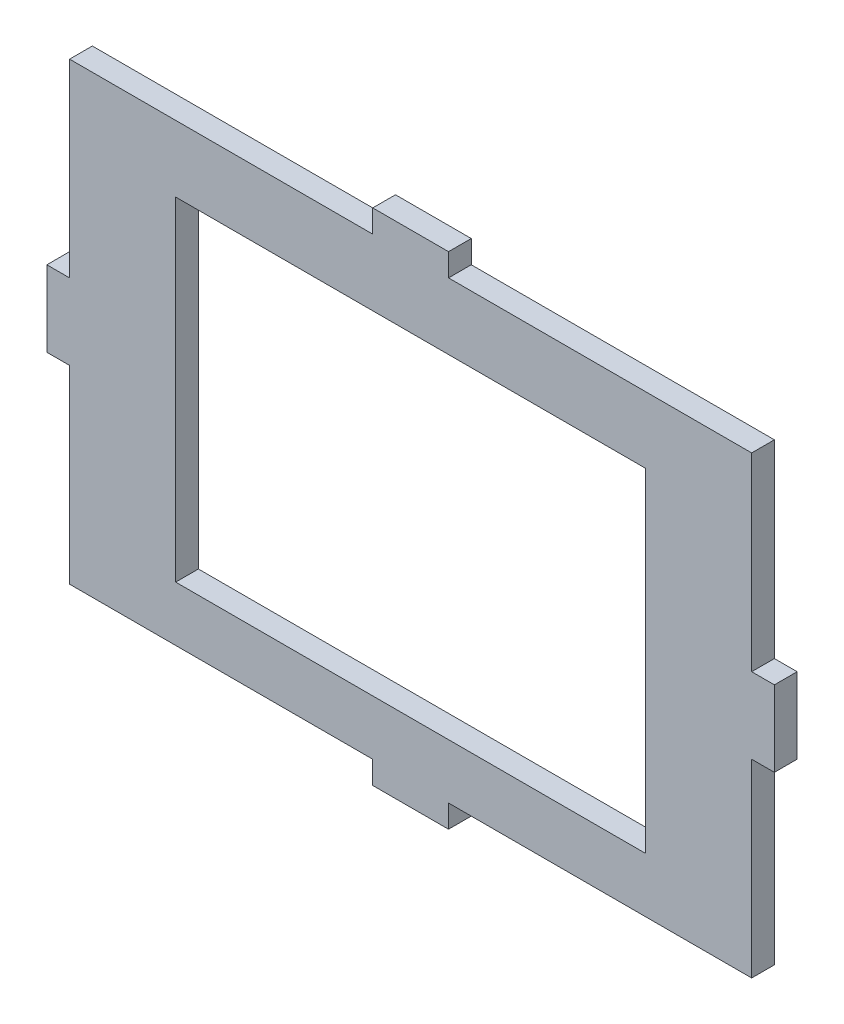
ISO-10303-21;
HEADER;
FILE_DESCRIPTION(('STEP AP214'),'2;1');
FILE_NAME('part.step','',(''),(''),'','','');
FILE_SCHEMA(('AUTOMOTIVE_DESIGN { 1 0 10303 214 1 1 1 1 }'));
ENDSEC;
DATA;
#1=APPLICATION_CONTEXT('core data for automotive mechanical design processes');
#2=APPLICATION_PROTOCOL_DEFINITION('international standard','automotive_design',2000,#1);
#3=PRODUCT_CONTEXT('',#1,'mechanical');
#4=PRODUCT('Part','Part','',(#3));
#5=PRODUCT_RELATED_PRODUCT_CATEGORY('part','',(#4));
#6=PRODUCT_DEFINITION_FORMATION('','',#4);
#7=PRODUCT_DEFINITION_CONTEXT('part definition',#1,'design');
#8=PRODUCT_DEFINITION('design','',#6,#7);
#9=PRODUCT_DEFINITION_SHAPE('','',#8);
#10=(LENGTH_UNIT() NAMED_UNIT(*) SI_UNIT(.MILLI.,.METRE.));
#11=(NAMED_UNIT(*) PLANE_ANGLE_UNIT() SI_UNIT($,.RADIAN.));
#12=(NAMED_UNIT(*) SI_UNIT($,.STERADIAN.) SOLID_ANGLE_UNIT());
#13=UNCERTAINTY_MEASURE_WITH_UNIT(LENGTH_MEASURE(1.E-05),#10,'distance_accuracy_value','');
#14=(GEOMETRIC_REPRESENTATION_CONTEXT(3) GLOBAL_UNCERTAINTY_ASSIGNED_CONTEXT((#13)) GLOBAL_UNIT_ASSIGNED_CONTEXT((#10,
#11,#12)) REPRESENTATION_CONTEXT('',''));
#15=CARTESIAN_POINT('',(0.,0.,0.));
#16=DIRECTION('',(0.,0.,1.));
#17=DIRECTION('',(1.,0.,0.));
#18=AXIS2_PLACEMENT_3D('',#15,#16,#17);
#19=CARTESIAN_POINT('',(0.,30.7594941139017,3.));
#20=DIRECTION('',(1.,0.,0.));
#21=DIRECTION('',(0.,0.,-1.));
#22=AXIS2_PLACEMENT_3D('',#19,#20,#21);
#23=PLANE('',#22);
#24=DIRECTION('',(0.,0.,-1.));
#25=VECTOR('',#24,1.);
#26=CARTESIAN_POINT('',(0.,5.76165506551438,0.));
#27=LINE('',#26,#25);
#28=CARTESIAN_POINT('',(0.,5.76165506551438,3.));
#29=VERTEX_POINT('',#28);
#30=CARTESIAN_POINT('',(0.,5.76165506551438,0.));
#31=VERTEX_POINT('',#30);
#32=EDGE_CURVE('E57',#29,#31,#27,.T.);
#33=ORIENTED_EDGE('',*,*,#32,.F.);
#34=DIRECTION('',(0.,-1.,0.));
#35=VECTOR('',#34,1.);
#36=CARTESIAN_POINT('',(0.,30.7594941139017,3.));
#37=LINE('',#36,#35);
#38=CARTESIAN_POINT('',(0.,30.7594941139017,3.));
#39=VERTEX_POINT('',#38);
#40=EDGE_CURVE('E217',#39,#29,#37,.T.);
#41=ORIENTED_EDGE('',*,*,#40,.F.);
#42=DIRECTION('',(0.,0.,-1.));
#43=VECTOR('',#42,1.);
#44=CARTESIAN_POINT('',(0.,30.7594941139017,3.));
#45=LINE('',#44,#43);
#46=CARTESIAN_POINT('',(0.,30.7594941139017,0.));
#47=VERTEX_POINT('',#46);
#48=EDGE_CURVE('E348',#39,#47,#45,.T.);
#49=ORIENTED_EDGE('',*,*,#48,.T.);
#50=DIRECTION('',(0.,-1.,0.));
#51=VECTOR('',#50,1.);
#52=CARTESIAN_POINT('',(0.,30.7594941139017,0.));
#53=LINE('',#52,#51);
#54=EDGE_CURVE('E349',#47,#31,#53,.T.);
#55=ORIENTED_EDGE('',*,*,#54,.T.);
#56=EDGE_LOOP('',(#33,#41,#49,#55));
#57=FACE_BOUND('',#56,.T.);
#58=ADVANCED_FACE('F34',(#57),#23,.F.);
#59=CARTESIAN_POINT('',(89.9870342903238,30.7594941139017,3.));
#60=DIRECTION('',(-1.,0.,0.));
#61=DIRECTION('',(0.,0.,1.));
#62=AXIS2_PLACEMENT_3D('',#59,#60,#61);
#63=PLANE('',#62);
#64=DIRECTION('',(0.,0.,-1.));
#65=VECTOR('',#64,1.);
#66=CARTESIAN_POINT('',(89.9870342903238,-4.23834493448562,0.));
#67=LINE('',#66,#65);
#68=CARTESIAN_POINT('',(89.9870342903238,-4.23834493448562,3.));
#69=VERTEX_POINT('',#68);
#70=CARTESIAN_POINT('',(89.9870342903238,-4.23834493448562,0.));
#71=VERTEX_POINT('',#70);
#72=EDGE_CURVE('E220',#69,#71,#67,.T.);
#73=ORIENTED_EDGE('',*,*,#72,.F.);
#74=DIRECTION('',(0.,1.,0.));
#75=VECTOR('',#74,1.);
#76=CARTESIAN_POINT('',(89.9870342903238,30.7594941139017,3.));
#77=LINE('',#76,#75);
#78=CARTESIAN_POINT('',(89.9870342903238,-29.2361839828729,3.));
#79=VERTEX_POINT('',#78);
#80=EDGE_CURVE('E341',#79,#69,#77,.T.);
#81=ORIENTED_EDGE('',*,*,#80,.F.);
#82=DIRECTION('',(0.,0.,-1.));
#83=VECTOR('',#82,1.);
#84=CARTESIAN_POINT('',(89.9870342903238,-29.2361839828729,3.));
#85=LINE('',#84,#83);
#86=CARTESIAN_POINT('',(89.9870342903238,-29.2361839828729,0.));
#87=VERTEX_POINT('',#86);
#88=EDGE_CURVE('E42',#79,#87,#85,.T.);
#89=ORIENTED_EDGE('',*,*,#88,.T.);
#90=DIRECTION('',(0.,1.,0.));
#91=VECTOR('',#90,1.);
#92=CARTESIAN_POINT('',(89.9870342903238,30.7594941139017,0.));
#93=LINE('',#92,#91);
#94=EDGE_CURVE('E355',#87,#71,#93,.T.);
#95=ORIENTED_EDGE('',*,*,#94,.T.);
#96=EDGE_LOOP('',(#73,#81,#89,#95));
#97=FACE_BOUND('',#96,.T.);
#98=ADVANCED_FACE('F369',(#97),#63,.F.);
#99=CARTESIAN_POINT('',(0.,-29.2361839828729,3.));
#100=DIRECTION('',(0.,1.,0.));
#101=DIRECTION('',(0.,0.,1.));
#102=AXIS2_PLACEMENT_3D('',#99,#100,#101);
#103=PLANE('',#102);
#104=DIRECTION('',(0.,0.,1.));
#105=VECTOR('',#104,1.);
#106=CARTESIAN_POINT('',(49.9935171451619,-29.2361839828729,0.));
#107=LINE('',#106,#105);
#108=CARTESIAN_POINT('',(49.9935171451619,-29.2361839828729,0.));
#109=VERTEX_POINT('',#108);
#110=CARTESIAN_POINT('',(49.9935171451619,-29.2361839828729,3.));
#111=VERTEX_POINT('',#110);
#112=EDGE_CURVE('E249',#109,#111,#107,.T.);
#113=ORIENTED_EDGE('',*,*,#112,.F.);
#114=DIRECTION('',(1.,0.,0.));
#115=VECTOR('',#114,1.);
#116=CARTESIAN_POINT('',(0.,-29.2361839828729,0.));
#117=LINE('',#116,#115);
#118=EDGE_CURVE('E351',#109,#87,#117,.T.);
#119=ORIENTED_EDGE('',*,*,#118,.T.);
#120=ORIENTED_EDGE('',*,*,#88,.F.);
#121=DIRECTION('',(1.,0.,0.));
#122=VECTOR('',#121,1.);
#123=CARTESIAN_POINT('',(0.,-29.2361839828729,3.));
#124=LINE('',#123,#122);
#125=EDGE_CURVE('E336',#111,#79,#124,.T.);
#126=ORIENTED_EDGE('',*,*,#125,.F.);
#127=EDGE_LOOP('',(#113,#119,#120,#126));
#128=FACE_BOUND('',#127,.T.);
#129=ADVANCED_FACE('F386',(#128),#103,.F.);
#130=CARTESIAN_POINT('',(0.,30.7594941139017,3.));
#131=DIRECTION('',(0.,-1.,0.));
#132=DIRECTION('',(0.,0.,-1.));
#133=AXIS2_PLACEMENT_3D('',#130,#131,#132);
#134=PLANE('',#133);
#135=DIRECTION('',(0.,0.,1.));
#136=VECTOR('',#135,1.);
#137=CARTESIAN_POINT('',(39.9935171451619,30.7594941139017,0.));
#138=LINE('',#137,#136);
#139=CARTESIAN_POINT('',(39.9935171451619,30.7594941139017,0.));
#140=VERTEX_POINT('',#139);
#141=CARTESIAN_POINT('',(39.9935171451619,30.7594941139017,3.));
#142=VERTEX_POINT('',#141);
#143=EDGE_CURVE('E281',#140,#142,#138,.T.);
#144=ORIENTED_EDGE('',*,*,#143,.F.);
#145=DIRECTION('',(-1.,0.,0.));
#146=VECTOR('',#145,1.);
#147=CARTESIAN_POINT('',(0.,30.7594941139017,0.));
#148=LINE('',#147,#146);
#149=EDGE_CURVE('E357',#140,#47,#148,.T.);
#150=ORIENTED_EDGE('',*,*,#149,.T.);
#151=ORIENTED_EDGE('',*,*,#48,.F.);
#152=DIRECTION('',(-1.,0.,0.));
#153=VECTOR('',#152,1.);
#154=CARTESIAN_POINT('',(0.,30.7594941139017,3.));
#155=LINE('',#154,#153);
#156=EDGE_CURVE('E344',#142,#39,#155,.T.);
#157=ORIENTED_EDGE('',*,*,#156,.F.);
#158=EDGE_LOOP('',(#144,#150,#151,#157));
#159=FACE_BOUND('',#158,.T.);
#160=ADVANCED_FACE('F414',(#159),#134,.F.);
#161=CARTESIAN_POINT('',(0.,-4.23834493448562,3.));
#162=VERTEX_POINT('',#161);
#163=CARTESIAN_POINT('',(0.,-29.2361839828729,3.));
#164=VERTEX_POINT('',#163);
#165=EDGE_CURVE('E49',#162,#164,#37,.T.);
#166=ORIENTED_EDGE('',*,*,#165,.F.);
#167=DIRECTION('',(0.,0.,-1.));
#168=VECTOR('',#167,1.);
#169=CARTESIAN_POINT('',(0.,-4.23834493448562,0.));
#170=LINE('',#169,#168);
#171=CARTESIAN_POINT('',(0.,-4.23834493448562,0.));
#172=VERTEX_POINT('',#171);
#173=EDGE_CURVE('E214',#162,#172,#170,.T.);
#174=ORIENTED_EDGE('',*,*,#173,.T.);
#175=CARTESIAN_POINT('',(0.,-29.2361839828729,0.));
#176=VERTEX_POINT('',#175);
#177=EDGE_CURVE('E328',#172,#176,#53,.T.);
#178=ORIENTED_EDGE('',*,*,#177,.T.);
#179=DIRECTION('',(0.,0.,-1.));
#180=VECTOR('',#179,1.);
#181=CARTESIAN_POINT('',(0.,-29.2361839828729,3.));
#182=LINE('',#181,#180);
#183=EDGE_CURVE('E11',#164,#176,#182,.T.);
#184=ORIENTED_EDGE('',*,*,#183,.F.);
#185=EDGE_LOOP('',(#166,#174,#178,#184));
#186=FACE_BOUND('',#185,.T.);
#187=ADVANCED_FACE('F36',(#186),#23,.F.);
#188=CARTESIAN_POINT('',(39.9935171451619,-29.2361839828729,0.));
#189=VERTEX_POINT('',#188);
#190=EDGE_CURVE('E352',#176,#189,#117,.T.);
#191=ORIENTED_EDGE('',*,*,#190,.T.);
#192=DIRECTION('',(0.,0.,1.));
#193=VECTOR('',#192,1.);
#194=CARTESIAN_POINT('',(39.9935171451619,-29.2361839828729,0.));
#195=LINE('',#194,#193);
#196=CARTESIAN_POINT('',(39.9935171451619,-29.2361839828729,3.));
#197=VERTEX_POINT('',#196);
#198=EDGE_CURVE('E254',#189,#197,#195,.T.);
#199=ORIENTED_EDGE('',*,*,#198,.T.);
#200=EDGE_CURVE('E337',#164,#197,#124,.T.);
#201=ORIENTED_EDGE('',*,*,#200,.F.);
#202=ORIENTED_EDGE('',*,*,#183,.T.);
#203=EDGE_LOOP('',(#191,#199,#201,#202));
#204=FACE_BOUND('',#203,.T.);
#205=ADVANCED_FACE('F400',(#204),#103,.F.);
#206=CARTESIAN_POINT('',(89.9870342903238,5.76165506551438,3.));
#207=VERTEX_POINT('',#206);
#208=CARTESIAN_POINT('',(89.9870342903238,30.7594941139017,3.));
#209=VERTEX_POINT('',#208);
#210=EDGE_CURVE('E340',#207,#209,#77,.T.);
#211=ORIENTED_EDGE('',*,*,#210,.F.);
#212=DIRECTION('',(0.,0.,-1.));
#213=VECTOR('',#212,1.);
#214=CARTESIAN_POINT('',(89.9870342903238,5.76165506551438,0.));
#215=LINE('',#214,#213);
#216=CARTESIAN_POINT('',(89.9870342903238,5.76165506551438,0.));
#217=VERTEX_POINT('',#216);
#218=EDGE_CURVE('E218',#207,#217,#215,.T.);
#219=ORIENTED_EDGE('',*,*,#218,.T.);
#220=CARTESIAN_POINT('',(89.9870342903238,30.7594941139017,0.));
#221=VERTEX_POINT('',#220);
#222=EDGE_CURVE('E354',#217,#221,#93,.T.);
#223=ORIENTED_EDGE('',*,*,#222,.T.);
#224=DIRECTION('',(0.,0.,-1.));
#225=VECTOR('',#224,1.);
#226=CARTESIAN_POINT('',(89.9870342903238,30.7594941139017,3.));
#227=LINE('',#226,#225);
#228=EDGE_CURVE('E362',#209,#221,#227,.T.);
#229=ORIENTED_EDGE('',*,*,#228,.F.);
#230=EDGE_LOOP('',(#211,#219,#223,#229));
#231=FACE_BOUND('',#230,.T.);
#232=ADVANCED_FACE('F419',(#231),#63,.F.);
#233=CARTESIAN_POINT('',(49.9935171451619,30.7594941139017,0.));
#234=VERTEX_POINT('',#233);
#235=EDGE_CURVE('E358',#221,#234,#148,.T.);
#236=ORIENTED_EDGE('',*,*,#235,.T.);
#237=DIRECTION('',(0.,0.,1.));
#238=VECTOR('',#237,1.);
#239=CARTESIAN_POINT('',(49.9935171451619,30.7594941139017,0.));
#240=LINE('',#239,#238);
#241=CARTESIAN_POINT('',(49.9935171451619,30.7594941139017,3.));
#242=VERTEX_POINT('',#241);
#243=EDGE_CURVE('E276',#234,#242,#240,.T.);
#244=ORIENTED_EDGE('',*,*,#243,.T.);
#245=EDGE_CURVE('E345',#209,#242,#155,.T.);
#246=ORIENTED_EDGE('',*,*,#245,.F.);
#247=ORIENTED_EDGE('',*,*,#228,.T.);
#248=EDGE_LOOP('',(#236,#244,#246,#247));
#249=FACE_BOUND('',#248,.T.);
#250=ADVANCED_FACE('F422',(#249),#134,.F.);
#251=CARTESIAN_POINT('',(0.,0.,3.));
#252=DIRECTION('',(0.,0.,1.));
#253=DIRECTION('',(1.,0.,0.));
#254=AXIS2_PLACEMENT_3D('',#251,#252,#253);
#255=PLANE('',#254);
#256=DIRECTION('',(0.,-1.,0.));
#257=VECTOR('',#256,1.);
#258=CARTESIAN_POINT('',(13.9935171451619,22.,3.));
#259=LINE('',#258,#257);
#260=CARTESIAN_POINT('',(13.9935171451619,22.,3.));
#261=VERTEX_POINT('',#260);
#262=CARTESIAN_POINT('',(13.9935171451619,-22.,3.));
#263=VERTEX_POINT('',#262);
#264=EDGE_CURVE('E302',#261,#263,#259,.T.);
#265=ORIENTED_EDGE('',*,*,#264,.F.);
#266=DIRECTION('',(-1.,0.,0.));
#267=VECTOR('',#266,1.);
#268=CARTESIAN_POINT('',(13.9935171451619,22.,3.));
#269=LINE('',#268,#267);
#270=CARTESIAN_POINT('',(75.9935171451619,22.,3.));
#271=VERTEX_POINT('',#270);
#272=EDGE_CURVE('E307',#271,#261,#269,.T.);
#273=ORIENTED_EDGE('',*,*,#272,.F.);
#274=DIRECTION('',(0.,1.,0.));
#275=VECTOR('',#274,1.);
#276=CARTESIAN_POINT('',(75.9935171451619,22.,3.));
#277=LINE('',#276,#275);
#278=CARTESIAN_POINT('',(75.9935171451619,-22.,3.));
#279=VERTEX_POINT('',#278);
#280=EDGE_CURVE('E321',#279,#271,#277,.T.);
#281=ORIENTED_EDGE('',*,*,#280,.F.);
#282=DIRECTION('',(1.,0.,0.));
#283=VECTOR('',#282,1.);
#284=CARTESIAN_POINT('',(13.9935171451619,-22.,3.));
#285=LINE('',#284,#283);
#286=EDGE_CURVE('E318',#263,#279,#285,.T.);
#287=ORIENTED_EDGE('',*,*,#286,.F.);
#288=EDGE_LOOP('',(#265,#273,#281,#287));
#289=FACE_BOUND('',#288,.T.);
#290=ORIENTED_EDGE('',*,*,#40,.T.);
#291=DIRECTION('',(1.,0.,0.));
#292=VECTOR('',#291,1.);
#293=CARTESIAN_POINT('',(-3.,5.76165506551438,3.));
#294=LINE('',#293,#292);
#295=CARTESIAN_POINT('',(-3.,5.76165506551438,3.));
#296=VERTEX_POINT('',#295);
#297=EDGE_CURVE('E200',#296,#29,#294,.T.);
#298=ORIENTED_EDGE('',*,*,#297,.F.);
#299=DIRECTION('',(0.,1.,0.));
#300=VECTOR('',#299,1.);
#301=CARTESIAN_POINT('',(-3.,0.,3.));
#302=LINE('',#301,#300);
#303=CARTESIAN_POINT('',(-3.,-4.23834493448562,3.));
#304=VERTEX_POINT('',#303);
#305=EDGE_CURVE('E206',#304,#296,#302,.T.);
#306=ORIENTED_EDGE('',*,*,#305,.F.);
#307=DIRECTION('',(1.,0.,0.));
#308=VECTOR('',#307,1.);
#309=CARTESIAN_POINT('',(-3.,-4.23834493448562,3.));
#310=LINE('',#309,#308);
#311=EDGE_CURVE('E401',#304,#162,#310,.T.);
#312=ORIENTED_EDGE('',*,*,#311,.T.);
#313=ORIENTED_EDGE('',*,*,#165,.T.);
#314=ORIENTED_EDGE('',*,*,#200,.T.);
#315=DIRECTION('',(0.,1.,0.));
#316=VECTOR('',#315,1.);
#317=CARTESIAN_POINT('',(39.9935171451619,-32.2361839828729,3.));
#318=LINE('',#317,#316);
#319=CARTESIAN_POINT('',(39.9935171451619,-32.2361839828729,3.));
#320=VERTEX_POINT('',#319);
#321=EDGE_CURVE('E267',#320,#197,#318,.T.);
#322=ORIENTED_EDGE('',*,*,#321,.F.);
#323=DIRECTION('',(-1.,0.,0.));
#324=VECTOR('',#323,1.);
#325=CARTESIAN_POINT('',(0.,-32.2361839828729,3.));
#326=LINE('',#325,#324);
#327=CARTESIAN_POINT('',(49.9935171451619,-32.2361839828729,3.));
#328=VERTEX_POINT('',#327);
#329=EDGE_CURVE('E256',#328,#320,#326,.T.);
#330=ORIENTED_EDGE('',*,*,#329,.F.);
#331=DIRECTION('',(0.,1.,0.));
#332=VECTOR('',#331,1.);
#333=CARTESIAN_POINT('',(49.9935171451619,-32.2361839828729,3.));
#334=LINE('',#333,#332);
#335=EDGE_CURVE('E270',#328,#111,#334,.T.);
#336=ORIENTED_EDGE('',*,*,#335,.T.);
#337=ORIENTED_EDGE('',*,*,#125,.T.);
#338=ORIENTED_EDGE('',*,*,#80,.T.);
#339=DIRECTION('',(-1.,0.,0.));
#340=VECTOR('',#339,1.);
#341=CARTESIAN_POINT('',(92.9870342903238,-4.23834493448562,3.));
#342=LINE('',#341,#340);
#343=CARTESIAN_POINT('',(92.9870342903238,-4.23834493448562,3.));
#344=VERTEX_POINT('',#343);
#345=EDGE_CURVE('E243',#344,#69,#342,.T.);
#346=ORIENTED_EDGE('',*,*,#345,.F.);
#347=DIRECTION('',(0.,-1.,0.));
#348=VECTOR('',#347,1.);
#349=CARTESIAN_POINT('',(92.9870342903238,0.,3.));
#350=LINE('',#349,#348);
#351=CARTESIAN_POINT('',(92.9870342903238,5.76165506551438,3.));
#352=VERTEX_POINT('',#351);
#353=EDGE_CURVE('E229',#352,#344,#350,.T.);
#354=ORIENTED_EDGE('',*,*,#353,.F.);
#355=DIRECTION('',(-1.,0.,0.));
#356=VECTOR('',#355,1.);
#357=CARTESIAN_POINT('',(92.9870342903238,5.76165506551438,3.));
#358=LINE('',#357,#356);
#359=EDGE_CURVE('E246',#352,#207,#358,.T.);
#360=ORIENTED_EDGE('',*,*,#359,.T.);
#361=ORIENTED_EDGE('',*,*,#210,.T.);
#362=ORIENTED_EDGE('',*,*,#245,.T.);
#363=DIRECTION('',(0.,-1.,0.));
#364=VECTOR('',#363,1.);
#365=CARTESIAN_POINT('',(49.9935171451619,33.7594941139017,3.));
#366=LINE('',#365,#364);
#367=CARTESIAN_POINT('',(49.9935171451619,33.7594941139017,3.));
#368=VERTEX_POINT('',#367);
#369=EDGE_CURVE('E287',#368,#242,#366,.T.);
#370=ORIENTED_EDGE('',*,*,#369,.F.);
#371=DIRECTION('',(1.,0.,0.));
#372=VECTOR('',#371,1.);
#373=CARTESIAN_POINT('',(0.,33.7594941139017,3.));
#374=LINE('',#373,#372);
#375=CARTESIAN_POINT('',(39.9935171451619,33.7594941139017,3.));
#376=VERTEX_POINT('',#375);
#377=EDGE_CURVE('E285',#376,#368,#374,.T.);
#378=ORIENTED_EDGE('',*,*,#377,.F.);
#379=DIRECTION('',(0.,-1.,0.));
#380=VECTOR('',#379,1.);
#381=CARTESIAN_POINT('',(39.9935171451619,33.7594941139017,3.));
#382=LINE('',#381,#380);
#383=EDGE_CURVE('E293',#376,#142,#382,.T.);
#384=ORIENTED_EDGE('',*,*,#383,.T.);
#385=ORIENTED_EDGE('',*,*,#156,.T.);
#386=EDGE_LOOP('',(#290,#298,#306,#312,#313,#314,#322,#330,#336,#337,#338,#346,#354,#360,#361,
#362,#370,#378,#384,#385));
#387=FACE_BOUND('',#386,.T.);
#388=ADVANCED_FACE('F216',(#289,#387),#255,.T.);
#389=CARTESIAN_POINT('',(0.,0.,0.));
#390=DIRECTION('',(0.,0.,1.));
#391=DIRECTION('',(1.,0.,0.));
#392=AXIS2_PLACEMENT_3D('',#389,#390,#391);
#393=PLANE('',#392);
#394=DIRECTION('',(-1.,0.,0.));
#395=VECTOR('',#394,1.);
#396=CARTESIAN_POINT('',(13.9935171451619,22.,0.));
#397=LINE('',#396,#395);
#398=CARTESIAN_POINT('',(75.9935171451619,22.,0.));
#399=VERTEX_POINT('',#398);
#400=CARTESIAN_POINT('',(13.9935171451619,22.,0.));
#401=VERTEX_POINT('',#400);
#402=EDGE_CURVE('E313',#399,#401,#397,.T.);
#403=ORIENTED_EDGE('',*,*,#402,.T.);
#404=DIRECTION('',(0.,-1.,0.));
#405=VECTOR('',#404,1.);
#406=CARTESIAN_POINT('',(13.9935171451619,22.,0.));
#407=LINE('',#406,#405);
#408=CARTESIAN_POINT('',(13.9935171451619,-22.,0.));
#409=VERTEX_POINT('',#408);
#410=EDGE_CURVE('E303',#401,#409,#407,.T.);
#411=ORIENTED_EDGE('',*,*,#410,.T.);
#412=DIRECTION('',(1.,0.,0.));
#413=VECTOR('',#412,1.);
#414=CARTESIAN_POINT('',(13.9935171451619,-22.,0.));
#415=LINE('',#414,#413);
#416=CARTESIAN_POINT('',(75.9935171451619,-22.,0.));
#417=VERTEX_POINT('',#416);
#418=EDGE_CURVE('E306',#409,#417,#415,.T.);
#419=ORIENTED_EDGE('',*,*,#418,.T.);
#420=DIRECTION('',(0.,1.,0.));
#421=VECTOR('',#420,1.);
#422=CARTESIAN_POINT('',(75.9935171451619,22.,0.));
#423=LINE('',#422,#421);
#424=EDGE_CURVE('E310',#417,#399,#423,.T.);
#425=ORIENTED_EDGE('',*,*,#424,.T.);
#426=EDGE_LOOP('',(#403,#411,#419,#425));
#427=FACE_BOUND('',#426,.T.);
#428=ORIENTED_EDGE('',*,*,#54,.F.);
#429=ORIENTED_EDGE('',*,*,#149,.F.);
#430=DIRECTION('',(0.,-1.,0.));
#431=VECTOR('',#430,1.);
#432=CARTESIAN_POINT('',(39.9935171451619,33.7594941139017,0.));
#433=LINE('',#432,#431);
#434=CARTESIAN_POINT('',(39.9935171451619,33.7594941139017,0.));
#435=VERTEX_POINT('',#434);
#436=EDGE_CURVE('E296',#435,#140,#433,.T.);
#437=ORIENTED_EDGE('',*,*,#436,.F.);
#438=DIRECTION('',(-1.,0.,0.));
#439=VECTOR('',#438,1.);
#440=CARTESIAN_POINT('',(0.,33.7594941139017,0.));
#441=LINE('',#440,#439);
#442=CARTESIAN_POINT('',(49.9935171451619,33.7594941139017,0.));
#443=VERTEX_POINT('',#442);
#444=EDGE_CURVE('E280',#443,#435,#441,.T.);
#445=ORIENTED_EDGE('',*,*,#444,.F.);
#446=DIRECTION('',(0.,-1.,0.));
#447=VECTOR('',#446,1.);
#448=CARTESIAN_POINT('',(49.9935171451619,33.7594941139017,0.));
#449=LINE('',#448,#447);
#450=EDGE_CURVE('E299',#443,#234,#449,.T.);
#451=ORIENTED_EDGE('',*,*,#450,.T.);
#452=ORIENTED_EDGE('',*,*,#235,.F.);
#453=ORIENTED_EDGE('',*,*,#222,.F.);
#454=DIRECTION('',(-1.,0.,0.));
#455=VECTOR('',#454,1.);
#456=CARTESIAN_POINT('',(92.9870342903238,5.76165506551438,0.));
#457=LINE('',#456,#455);
#458=CARTESIAN_POINT('',(92.9870342903238,5.76165506551438,0.));
#459=VERTEX_POINT('',#458);
#460=EDGE_CURVE('E234',#459,#217,#457,.T.);
#461=ORIENTED_EDGE('',*,*,#460,.F.);
#462=DIRECTION('',(0.,1.,0.));
#463=VECTOR('',#462,1.);
#464=CARTESIAN_POINT('',(92.9870342903238,0.,0.));
#465=LINE('',#464,#463);
#466=CARTESIAN_POINT('',(92.9870342903238,-4.23834493448562,0.));
#467=VERTEX_POINT('',#466);
#468=EDGE_CURVE('E233',#467,#459,#465,.T.);
#469=ORIENTED_EDGE('',*,*,#468,.F.);
#470=DIRECTION('',(-1.,0.,0.));
#471=VECTOR('',#470,1.);
#472=CARTESIAN_POINT('',(92.9870342903238,-4.23834493448562,0.));
#473=LINE('',#472,#471);
#474=EDGE_CURVE('E240',#467,#71,#473,.T.);
#475=ORIENTED_EDGE('',*,*,#474,.T.);
#476=ORIENTED_EDGE('',*,*,#94,.F.);
#477=ORIENTED_EDGE('',*,*,#118,.F.);
#478=DIRECTION('',(0.,1.,0.));
#479=VECTOR('',#478,1.);
#480=CARTESIAN_POINT('',(49.9935171451619,-32.2361839828729,0.));
#481=LINE('',#480,#479);
#482=CARTESIAN_POINT('',(49.9935171451619,-32.2361839828729,0.));
#483=VERTEX_POINT('',#482);
#484=EDGE_CURVE('E273',#483,#109,#481,.T.);
#485=ORIENTED_EDGE('',*,*,#484,.F.);
#486=DIRECTION('',(1.,0.,0.));
#487=VECTOR('',#486,1.);
#488=CARTESIAN_POINT('',(0.,-32.2361839828729,0.));
#489=LINE('',#488,#487);
#490=CARTESIAN_POINT('',(39.9935171451619,-32.2361839828729,0.));
#491=VERTEX_POINT('',#490);
#492=EDGE_CURVE('E250',#491,#483,#489,.T.);
#493=ORIENTED_EDGE('',*,*,#492,.F.);
#494=DIRECTION('',(0.,1.,0.));
#495=VECTOR('',#494,1.);
#496=CARTESIAN_POINT('',(39.9935171451619,-32.2361839828729,0.));
#497=LINE('',#496,#495);
#498=EDGE_CURVE('E261',#491,#189,#497,.T.);
#499=ORIENTED_EDGE('',*,*,#498,.T.);
#500=ORIENTED_EDGE('',*,*,#190,.F.);
#501=ORIENTED_EDGE('',*,*,#177,.F.);
#502=DIRECTION('',(1.,0.,0.));
#503=VECTOR('',#502,1.);
#504=CARTESIAN_POINT('',(-3.,-4.23834493448562,0.));
#505=LINE('',#504,#503);
#506=CARTESIAN_POINT('',(-3.,-4.23834493448562,0.));
#507=VERTEX_POINT('',#506);
#508=EDGE_CURVE('E222',#507,#172,#505,.T.);
#509=ORIENTED_EDGE('',*,*,#508,.F.);
#510=DIRECTION('',(0.,-1.,0.));
#511=VECTOR('',#510,1.);
#512=CARTESIAN_POINT('',(-3.,0.,0.));
#513=LINE('',#512,#511);
#514=CARTESIAN_POINT('',(-3.,5.76165506551438,0.));
#515=VERTEX_POINT('',#514);
#516=EDGE_CURVE('E205',#515,#507,#513,.T.);
#517=ORIENTED_EDGE('',*,*,#516,.F.);
#518=DIRECTION('',(1.,0.,0.));
#519=VECTOR('',#518,1.);
#520=CARTESIAN_POINT('',(-3.,5.76165506551438,0.));
#521=LINE('',#520,#519);
#522=EDGE_CURVE('E202',#515,#31,#521,.T.);
#523=ORIENTED_EDGE('',*,*,#522,.T.);
#524=EDGE_LOOP('',(#428,#429,#437,#445,#451,#452,#453,#461,#469,#475,#476,#477,#485,#493,#499,
#500,#501,#509,#517,#523));
#525=FACE_BOUND('',#524,.T.);
#526=ADVANCED_FACE('F374',(#427,#525),#393,.F.);
#527=CARTESIAN_POINT('',(13.9935171451619,22.,0.));
#528=DIRECTION('',(-1.,0.,0.));
#529=DIRECTION('',(0.,0.,1.));
#530=AXIS2_PLACEMENT_3D('',#527,#528,#529);
#531=PLANE('',#530);
#532=ORIENTED_EDGE('',*,*,#264,.T.);
#533=DIRECTION('',(0.,0.,1.));
#534=VECTOR('',#533,1.);
#535=CARTESIAN_POINT('',(13.9935171451619,-22.,0.));
#536=LINE('',#535,#534);
#537=EDGE_CURVE('E316',#409,#263,#536,.T.);
#538=ORIENTED_EDGE('',*,*,#537,.F.);
#539=ORIENTED_EDGE('',*,*,#410,.F.);
#540=DIRECTION('',(0.,0.,1.));
#541=VECTOR('',#540,1.);
#542=CARTESIAN_POINT('',(13.9935171451619,22.,0.));
#543=LINE('',#542,#541);
#544=EDGE_CURVE('E326',#401,#261,#543,.T.);
#545=ORIENTED_EDGE('',*,*,#544,.T.);
#546=EDGE_LOOP('',(#532,#538,#539,#545));
#547=FACE_BOUND('',#546,.T.);
#548=ADVANCED_FACE('F476',(#547),#531,.F.);
#549=CARTESIAN_POINT('',(13.9935171451619,22.,0.));
#550=DIRECTION('',(0.,1.,0.));
#551=DIRECTION('',(0.,0.,1.));
#552=AXIS2_PLACEMENT_3D('',#549,#550,#551);
#553=PLANE('',#552);
#554=ORIENTED_EDGE('',*,*,#272,.T.);
#555=ORIENTED_EDGE('',*,*,#544,.F.);
#556=ORIENTED_EDGE('',*,*,#402,.F.);
#557=DIRECTION('',(0.,0.,1.));
#558=VECTOR('',#557,1.);
#559=CARTESIAN_POINT('',(75.9935171451619,22.,0.));
#560=LINE('',#559,#558);
#561=EDGE_CURVE('E329',#399,#271,#560,.T.);
#562=ORIENTED_EDGE('',*,*,#561,.T.);
#563=EDGE_LOOP('',(#554,#555,#556,#562));
#564=FACE_BOUND('',#563,.T.);
#565=ADVANCED_FACE('F472',(#564),#553,.F.);
#566=CARTESIAN_POINT('',(75.9935171451619,22.,0.));
#567=DIRECTION('',(1.,0.,0.));
#568=DIRECTION('',(0.,0.,-1.));
#569=AXIS2_PLACEMENT_3D('',#566,#567,#568);
#570=PLANE('',#569);
#571=ORIENTED_EDGE('',*,*,#280,.T.);
#572=ORIENTED_EDGE('',*,*,#561,.F.);
#573=ORIENTED_EDGE('',*,*,#424,.F.);
#574=DIRECTION('',(0.,0.,1.));
#575=VECTOR('',#574,1.);
#576=CARTESIAN_POINT('',(75.9935171451619,-22.,0.));
#577=LINE('',#576,#575);
#578=EDGE_CURVE('E331',#417,#279,#577,.T.);
#579=ORIENTED_EDGE('',*,*,#578,.T.);
#580=EDGE_LOOP('',(#571,#572,#573,#579));
#581=FACE_BOUND('',#580,.T.);
#582=ADVANCED_FACE('F475',(#581),#570,.F.);
#583=CARTESIAN_POINT('',(13.9935171451619,-22.,0.));
#584=DIRECTION('',(0.,-1.,0.));
#585=DIRECTION('',(0.,0.,-1.));
#586=AXIS2_PLACEMENT_3D('',#583,#584,#585);
#587=PLANE('',#586);
#588=ORIENTED_EDGE('',*,*,#286,.T.);
#589=ORIENTED_EDGE('',*,*,#578,.F.);
#590=ORIENTED_EDGE('',*,*,#418,.F.);
#591=ORIENTED_EDGE('',*,*,#537,.T.);
#592=EDGE_LOOP('',(#588,#589,#590,#591));
#593=FACE_BOUND('',#592,.T.);
#594=ADVANCED_FACE('F468',(#593),#587,.F.);
#595=CARTESIAN_POINT('',(49.9935171451619,33.7594941139017,0.));
#596=DIRECTION('',(1.,0.,0.));
#597=DIRECTION('',(0.,0.,-1.));
#598=AXIS2_PLACEMENT_3D('',#595,#596,#597);
#599=PLANE('',#598);
#600=ORIENTED_EDGE('',*,*,#243,.F.);
#601=ORIENTED_EDGE('',*,*,#450,.F.);
#602=DIRECTION('',(0.,0.,1.));
#603=VECTOR('',#602,1.);
#604=CARTESIAN_POINT('',(49.9935171451619,33.7594941139017,0.));
#605=LINE('',#604,#603);
#606=EDGE_CURVE('E277',#443,#368,#605,.T.);
#607=ORIENTED_EDGE('',*,*,#606,.T.);
#608=ORIENTED_EDGE('',*,*,#369,.T.);
#609=EDGE_LOOP('',(#600,#601,#607,#608));
#610=FACE_BOUND('',#609,.T.);
#611=ADVANCED_FACE('F449',(#610),#599,.T.);
#612=CARTESIAN_POINT('',(39.9935171451619,33.7594941139017,0.));
#613=DIRECTION('',(1.,0.,0.));
#614=DIRECTION('',(0.,0.,-1.));
#615=AXIS2_PLACEMENT_3D('',#612,#613,#614);
#616=PLANE('',#615);
#617=ORIENTED_EDGE('',*,*,#143,.T.);
#618=ORIENTED_EDGE('',*,*,#383,.F.);
#619=DIRECTION('',(0.,0.,1.));
#620=VECTOR('',#619,1.);
#621=CARTESIAN_POINT('',(39.9935171451619,33.7594941139017,0.));
#622=LINE('',#621,#620);
#623=EDGE_CURVE('E283',#435,#376,#622,.T.);
#624=ORIENTED_EDGE('',*,*,#623,.F.);
#625=ORIENTED_EDGE('',*,*,#436,.T.);
#626=EDGE_LOOP('',(#617,#618,#624,#625));
#627=FACE_BOUND('',#626,.T.);
#628=ADVANCED_FACE('F459',(#627),#616,.F.);
#629=CARTESIAN_POINT('',(0.,33.7594941139017,0.));
#630=DIRECTION('',(0.,1.,0.));
#631=DIRECTION('',(0.,0.,1.));
#632=AXIS2_PLACEMENT_3D('',#629,#630,#631);
#633=PLANE('',#632);
#634=ORIENTED_EDGE('',*,*,#606,.F.);
#635=ORIENTED_EDGE('',*,*,#444,.T.);
#636=ORIENTED_EDGE('',*,*,#623,.T.);
#637=ORIENTED_EDGE('',*,*,#377,.T.);
#638=EDGE_LOOP('',(#634,#635,#636,#637));
#639=FACE_BOUND('',#638,.T.);
#640=ADVANCED_FACE('F453',(#639),#633,.T.);
#641=CARTESIAN_POINT('',(49.9935171451619,-32.2361839828729,0.));
#642=DIRECTION('',(-1.,0.,0.));
#643=DIRECTION('',(0.,0.,1.));
#644=AXIS2_PLACEMENT_3D('',#641,#642,#643);
#645=PLANE('',#644);
#646=ORIENTED_EDGE('',*,*,#112,.T.);
#647=ORIENTED_EDGE('',*,*,#335,.F.);
#648=DIRECTION('',(0.,0.,1.));
#649=VECTOR('',#648,1.);
#650=CARTESIAN_POINT('',(49.9935171451619,-32.2361839828729,0.));
#651=LINE('',#650,#649);
#652=EDGE_CURVE('E253',#483,#328,#651,.T.);
#653=ORIENTED_EDGE('',*,*,#652,.F.);
#654=ORIENTED_EDGE('',*,*,#484,.T.);
#655=EDGE_LOOP('',(#646,#647,#653,#654));
#656=FACE_BOUND('',#655,.T.);
#657=ADVANCED_FACE('F388',(#656),#645,.F.);
#658=CARTESIAN_POINT('',(39.9935171451619,-32.2361839828729,0.));
#659=DIRECTION('',(-1.,0.,0.));
#660=DIRECTION('',(0.,0.,1.));
#661=AXIS2_PLACEMENT_3D('',#658,#659,#660);
#662=PLANE('',#661);
#663=ORIENTED_EDGE('',*,*,#198,.F.);
#664=ORIENTED_EDGE('',*,*,#498,.F.);
#665=DIRECTION('',(0.,0.,1.));
#666=VECTOR('',#665,1.);
#667=CARTESIAN_POINT('',(39.9935171451619,-32.2361839828729,0.));
#668=LINE('',#667,#666);
#669=EDGE_CURVE('E258',#491,#320,#668,.T.);
#670=ORIENTED_EDGE('',*,*,#669,.T.);
#671=ORIENTED_EDGE('',*,*,#321,.T.);
#672=EDGE_LOOP('',(#663,#664,#670,#671));
#673=FACE_BOUND('',#672,.T.);
#674=ADVANCED_FACE('F397',(#673),#662,.T.);
#675=CARTESIAN_POINT('',(0.,-32.2361839828729,0.));
#676=DIRECTION('',(0.,-1.,0.));
#677=DIRECTION('',(0.,0.,-1.));
#678=AXIS2_PLACEMENT_3D('',#675,#676,#677);
#679=PLANE('',#678);
#680=ORIENTED_EDGE('',*,*,#492,.T.);
#681=ORIENTED_EDGE('',*,*,#652,.T.);
#682=ORIENTED_EDGE('',*,*,#329,.T.);
#683=ORIENTED_EDGE('',*,*,#669,.F.);
#684=EDGE_LOOP('',(#680,#681,#682,#683));
#685=FACE_BOUND('',#684,.T.);
#686=ADVANCED_FACE('F394',(#685),#679,.T.);
#687=CARTESIAN_POINT('',(92.9870342903238,5.76165506551438,0.));
#688=DIRECTION('',(0.,1.,0.));
#689=DIRECTION('',(0.,0.,1.));
#690=AXIS2_PLACEMENT_3D('',#687,#688,#689);
#691=PLANE('',#690);
#692=ORIENTED_EDGE('',*,*,#218,.F.);
#693=ORIENTED_EDGE('',*,*,#359,.F.);
#694=DIRECTION('',(0.,0.,-1.));
#695=VECTOR('',#694,1.);
#696=CARTESIAN_POINT('',(92.9870342903238,5.76165506551438,0.));
#697=LINE('',#696,#695);
#698=EDGE_CURVE('E226',#352,#459,#697,.T.);
#699=ORIENTED_EDGE('',*,*,#698,.T.);
#700=ORIENTED_EDGE('',*,*,#460,.T.);
#701=EDGE_LOOP('',(#692,#693,#699,#700));
#702=FACE_BOUND('',#701,.T.);
#703=ADVANCED_FACE('F443',(#702),#691,.T.);
#704=CARTESIAN_POINT('',(92.9870342903238,-4.23834493448562,0.));
#705=DIRECTION('',(0.,1.,0.));
#706=DIRECTION('',(0.,0.,1.));
#707=AXIS2_PLACEMENT_3D('',#704,#705,#706);
#708=PLANE('',#707);
#709=ORIENTED_EDGE('',*,*,#72,.T.);
#710=ORIENTED_EDGE('',*,*,#474,.F.);
#711=DIRECTION('',(0.,0.,-1.));
#712=VECTOR('',#711,1.);
#713=CARTESIAN_POINT('',(92.9870342903238,-4.23834493448562,0.));
#714=LINE('',#713,#712);
#715=EDGE_CURVE('E231',#344,#467,#714,.T.);
#716=ORIENTED_EDGE('',*,*,#715,.F.);
#717=ORIENTED_EDGE('',*,*,#345,.T.);
#718=EDGE_LOOP('',(#709,#710,#716,#717));
#719=FACE_BOUND('',#718,.T.);
#720=ADVANCED_FACE('F381',(#719),#708,.F.);
#721=CARTESIAN_POINT('',(92.9870342903238,0.,0.));
#722=DIRECTION('',(1.,0.,0.));
#723=DIRECTION('',(0.,0.,-1.));
#724=AXIS2_PLACEMENT_3D('',#721,#722,#723);
#725=PLANE('',#724);
#726=ORIENTED_EDGE('',*,*,#698,.F.);
#727=ORIENTED_EDGE('',*,*,#353,.T.);
#728=ORIENTED_EDGE('',*,*,#715,.T.);
#729=ORIENTED_EDGE('',*,*,#468,.T.);
#730=EDGE_LOOP('',(#726,#727,#728,#729));
#731=FACE_BOUND('',#730,.T.);
#732=ADVANCED_FACE('F608',(#731),#725,.T.);
#733=CARTESIAN_POINT('',(-3.,5.76165506551438,0.));
#734=DIRECTION('',(0.,-1.,0.));
#735=DIRECTION('',(0.,0.,-1.));
#736=AXIS2_PLACEMENT_3D('',#733,#734,#735);
#737=PLANE('',#736);
#738=ORIENTED_EDGE('',*,*,#32,.T.);
#739=ORIENTED_EDGE('',*,*,#522,.F.);
#740=DIRECTION('',(0.,0.,-1.));
#741=VECTOR('',#740,1.);
#742=CARTESIAN_POINT('',(-3.,5.76165506551438,0.));
#743=LINE('',#742,#741);
#744=EDGE_CURVE('E196',#296,#515,#743,.T.);
#745=ORIENTED_EDGE('',*,*,#744,.F.);
#746=ORIENTED_EDGE('',*,*,#297,.T.);
#747=EDGE_LOOP('',(#738,#739,#745,#746));
#748=FACE_BOUND('',#747,.T.);
#749=ADVANCED_FACE('F198',(#748),#737,.F.);
#750=CARTESIAN_POINT('',(-3.,-4.23834493448562,0.));
#751=DIRECTION('',(0.,-1.,0.));
#752=DIRECTION('',(0.,0.,-1.));
#753=AXIS2_PLACEMENT_3D('',#750,#751,#752);
#754=PLANE('',#753);
#755=ORIENTED_EDGE('',*,*,#173,.F.);
#756=ORIENTED_EDGE('',*,*,#311,.F.);
#757=DIRECTION('',(0.,0.,-1.));
#758=VECTOR('',#757,1.);
#759=CARTESIAN_POINT('',(-3.,-4.23834493448562,0.));
#760=LINE('',#759,#758);
#761=EDGE_CURVE('E212',#304,#507,#760,.T.);
#762=ORIENTED_EDGE('',*,*,#761,.T.);
#763=ORIENTED_EDGE('',*,*,#508,.T.);
#764=EDGE_LOOP('',(#755,#756,#762,#763));
#765=FACE_BOUND('',#764,.T.);
#766=ADVANCED_FACE('F406',(#765),#754,.T.);
#767=CARTESIAN_POINT('',(-3.,0.,0.));
#768=DIRECTION('',(-1.,0.,0.));
#769=DIRECTION('',(0.,0.,1.));
#770=AXIS2_PLACEMENT_3D('',#767,#768,#769);
#771=PLANE('',#770);
#772=ORIENTED_EDGE('',*,*,#305,.T.);
#773=ORIENTED_EDGE('',*,*,#744,.T.);
#774=ORIENTED_EDGE('',*,*,#516,.T.);
#775=ORIENTED_EDGE('',*,*,#761,.F.);
#776=EDGE_LOOP('',(#772,#773,#774,#775));
#777=FACE_BOUND('',#776,.T.);
#778=ADVANCED_FACE('F210',(#777),#771,.T.);
#779=CLOSED_SHELL('',(#58,#98,#129,#160,#187,#205,#232,#250,#388,#526,#548,#565,#582,#594,#611,
#628,#640,#657,#674,#686,#703,#720,#732,#749,#766,#778));
#780=MANIFOLD_SOLID_BREP('B2',#779);
#781=ADVANCED_BREP_SHAPE_REPRESENTATION('',(#18,#780),#14);
#782=SHAPE_DEFINITION_REPRESENTATION(#9,#781);
ENDSEC;
END-ISO-10303-21;
